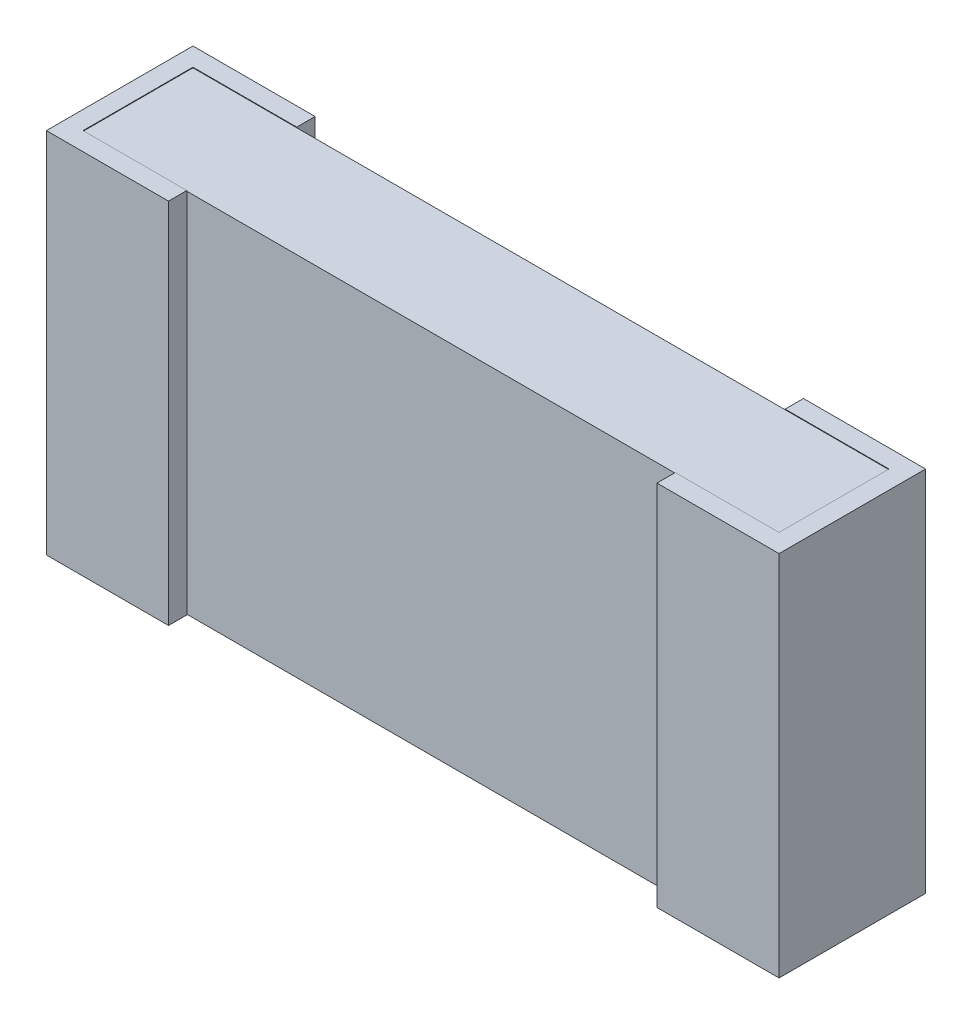
ISO-10303-21;
HEADER;
FILE_DESCRIPTION(('STEP AP214'),'2;1');
FILE_NAME('part.step','',(''),(''),'','','');
FILE_SCHEMA(('AUTOMOTIVE_DESIGN { 1 0 10303 214 1 1 1 1 }'));
ENDSEC;
DATA;
#1=APPLICATION_CONTEXT('core data for automotive mechanical design processes');
#2=APPLICATION_PROTOCOL_DEFINITION('international standard','automotive_design',2000,#1);
#3=PRODUCT_CONTEXT('',#1,'mechanical');
#4=PRODUCT('Part','Part','',(#3));
#5=PRODUCT_RELATED_PRODUCT_CATEGORY('part','',(#4));
#6=PRODUCT_DEFINITION_FORMATION('','',#4);
#7=PRODUCT_DEFINITION_CONTEXT('part definition',#1,'design');
#8=PRODUCT_DEFINITION('design','',#6,#7);
#9=PRODUCT_DEFINITION_SHAPE('','',#8);
#10=(LENGTH_UNIT() NAMED_UNIT(*) SI_UNIT(.MILLI.,.METRE.));
#11=(NAMED_UNIT(*) PLANE_ANGLE_UNIT() SI_UNIT($,.RADIAN.));
#12=(NAMED_UNIT(*) SI_UNIT($,.STERADIAN.) SOLID_ANGLE_UNIT());
#13=UNCERTAINTY_MEASURE_WITH_UNIT(LENGTH_MEASURE(1.E-05),#10,'distance_accuracy_value','');
#14=(GEOMETRIC_REPRESENTATION_CONTEXT(3) GLOBAL_UNCERTAINTY_ASSIGNED_CONTEXT((#13)) GLOBAL_UNIT_ASSIGNED_CONTEXT((#10,
#11,#12)) REPRESENTATION_CONTEXT('',''));
#15=CARTESIAN_POINT('',(0.,0.,0.));
#16=DIRECTION('',(0.,0.,1.));
#17=DIRECTION('',(1.,0.,0.));
#18=AXIS2_PLACEMENT_3D('',#15,#16,#17);
#19=CARTESIAN_POINT('',(0.507999999999976,-0.76454,0.));
#20=DIRECTION('',(0.,0.,-1.));
#21=DIRECTION('',(-1.,0.,0.));
#22=AXIS2_PLACEMENT_3D('',#19,#20,#21);
#23=PLANE('',#22);
#24=DIRECTION('',(-1.,0.,0.));
#25=VECTOR('',#24,1.);
#26=CARTESIAN_POINT('',(0.507999999999976,-0.76454,0.));
#27=LINE('',#26,#25);
#28=CARTESIAN_POINT('',(0.507999999999976,-0.76454,0.));
#29=VERTEX_POINT('',#28);
#30=CARTESIAN_POINT('',(0.,-0.76454,0.));
#31=VERTEX_POINT('',#30);
#32=EDGE_CURVE('E181',#29,#31,#27,.T.);
#33=ORIENTED_EDGE('',*,*,#32,.T.);
#34=DIRECTION('',(0.,1.,0.));
#35=VECTOR('',#34,1.);
#36=CARTESIAN_POINT('',(0.,-0.76454,0.));
#37=LINE('',#36,#35);
#38=CARTESIAN_POINT('',(0.,0.76454,0.));
#39=VERTEX_POINT('',#38);
#40=EDGE_CURVE('E183',#39,#31,#37,.F.);
#41=ORIENTED_EDGE('',*,*,#40,.F.);
#42=DIRECTION('',(-1.,0.,0.));
#43=VECTOR('',#42,1.);
#44=CARTESIAN_POINT('',(0.507999999999976,0.76454,0.));
#45=LINE('',#44,#43);
#46=CARTESIAN_POINT('',(0.507999999999976,0.76454,0.));
#47=VERTEX_POINT('',#46);
#48=EDGE_CURVE('E20',#39,#47,#45,.F.);
#49=ORIENTED_EDGE('',*,*,#48,.T.);
#50=DIRECTION('',(0.,1.,0.));
#51=VECTOR('',#50,1.);
#52=CARTESIAN_POINT('',(0.507999999999976,-0.76454,0.));
#53=LINE('',#52,#51);
#54=EDGE_CURVE('E186',#29,#47,#53,.T.);
#55=ORIENTED_EDGE('',*,*,#54,.F.);
#56=EDGE_LOOP('',(#33,#41,#49,#55));
#57=FACE_BOUND('',#56,.T.);
#58=ADVANCED_FACE('F17',(#57),#23,.T.);
#59=CARTESIAN_POINT('',(2.54000000000002,-0.76454,0.));
#60=DIRECTION('',(0.,0.,1.));
#61=DIRECTION('',(1.,0.,0.));
#62=AXIS2_PLACEMENT_3D('',#59,#60,#61);
#63=PLANE('',#62);
#64=DIRECTION('',(0.,1.,0.));
#65=VECTOR('',#64,1.);
#66=CARTESIAN_POINT('',(3.048,-0.76454,0.));
#67=LINE('',#66,#65);
#68=CARTESIAN_POINT('',(3.048,0.76454,0.));
#69=VERTEX_POINT('',#68);
#70=CARTESIAN_POINT('',(3.048,-0.76454,0.));
#71=VERTEX_POINT('',#70);
#72=EDGE_CURVE('E220',#69,#71,#67,.F.);
#73=ORIENTED_EDGE('',*,*,#72,.T.);
#74=DIRECTION('',(1.,0.,0.));
#75=VECTOR('',#74,1.);
#76=CARTESIAN_POINT('',(2.54000000000002,-0.76454,0.));
#77=LINE('',#76,#75);
#78=CARTESIAN_POINT('',(2.54000000000001,-0.76454,0.));
#79=VERTEX_POINT('',#78);
#80=EDGE_CURVE('E175',#79,#71,#77,.T.);
#81=ORIENTED_EDGE('',*,*,#80,.F.);
#82=DIRECTION('',(0.,1.,0.));
#83=VECTOR('',#82,1.);
#84=CARTESIAN_POINT('',(2.54000000000002,-0.76454,0.));
#85=LINE('',#84,#83);
#86=CARTESIAN_POINT('',(2.54000000000002,0.76454,0.));
#87=VERTEX_POINT('',#86);
#88=EDGE_CURVE('E230',#79,#87,#85,.T.);
#89=ORIENTED_EDGE('',*,*,#88,.T.);
#90=DIRECTION('',(1.,0.,0.));
#91=VECTOR('',#90,1.);
#92=CARTESIAN_POINT('',(2.54000000000002,0.76454,0.));
#93=LINE('',#92,#91);
#94=EDGE_CURVE('E196',#69,#87,#93,.F.);
#95=ORIENTED_EDGE('',*,*,#94,.F.);
#96=EDGE_LOOP('',(#73,#81,#89,#95));
#97=FACE_BOUND('',#96,.T.);
#98=ADVANCED_FACE('F227',(#97),#63,.F.);
#99=CARTESIAN_POINT('',(0.,-0.76454,0.));
#100=DIRECTION('',(-1.,0.,0.));
#101=DIRECTION('',(0.,0.,1.));
#102=AXIS2_PLACEMENT_3D('',#99,#100,#101);
#103=PLANE('',#102);
#104=DIRECTION('',(0.,0.,1.));
#105=VECTOR('',#104,1.);
#106=CARTESIAN_POINT('',(0.,-0.76454,0.));
#107=LINE('',#106,#105);
#108=CARTESIAN_POINT('',(0.,-0.76454,0.609599999999878));
#109=VERTEX_POINT('',#108);
#110=EDGE_CURVE('E193',#31,#109,#107,.T.);
#111=ORIENTED_EDGE('',*,*,#110,.T.);
#112=DIRECTION('',(0.,1.,0.));
#113=VECTOR('',#112,1.);
#114=CARTESIAN_POINT('',(0.,-0.76454,0.609599999999878));
#115=LINE('',#114,#113);
#116=CARTESIAN_POINT('',(0.,0.76454,0.609599999999878));
#117=VERTEX_POINT('',#116);
#118=EDGE_CURVE('E250',#117,#109,#115,.F.);
#119=ORIENTED_EDGE('',*,*,#118,.F.);
#120=DIRECTION('',(0.,0.,-1.));
#121=VECTOR('',#120,1.);
#122=CARTESIAN_POINT('',(0.,0.76454,0.533400000000122));
#123=LINE('',#122,#121);
#124=EDGE_CURVE('E195',#117,#39,#123,.T.);
#125=ORIENTED_EDGE('',*,*,#124,.T.);
#126=ORIENTED_EDGE('',*,*,#40,.T.);
#127=EDGE_LOOP('',(#111,#119,#125,#126));
#128=FACE_BOUND('',#127,.T.);
#129=ADVANCED_FACE('F191',(#128),#103,.T.);
#130=CARTESIAN_POINT('',(0.508,-0.76454,0.0762000000001224));
#131=DIRECTION('',(1.,0.,-3.10178574280132E-13));
#132=DIRECTION('',(-3.10178574280132E-13,0.,-1.));
#133=AXIS2_PLACEMENT_3D('',#130,#131,#132);
#134=PLANE('',#133);
#135=DIRECTION('',(0.,0.,-1.));
#136=VECTOR('',#135,1.);
#137=CARTESIAN_POINT('',(0.507999999999976,-0.76454,0.533400000000122));
#138=LINE('',#137,#136);
#139=CARTESIAN_POINT('',(0.507999999999994,-0.76454,0.0762000000001224));
#140=VERTEX_POINT('',#139);
#141=EDGE_CURVE('E242',#29,#140,#138,.F.);
#142=ORIENTED_EDGE('',*,*,#141,.F.);
#143=ORIENTED_EDGE('',*,*,#54,.T.);
#144=DIRECTION('',(0.,0.,-1.));
#145=VECTOR('',#144,1.);
#146=CARTESIAN_POINT('',(0.507999999999976,0.76454,0.533400000000122));
#147=LINE('',#146,#145);
#148=CARTESIAN_POINT('',(0.507999999999994,0.76454,0.0762000000001224));
#149=VERTEX_POINT('',#148);
#150=EDGE_CURVE('E239',#47,#149,#147,.F.);
#151=ORIENTED_EDGE('',*,*,#150,.T.);
#152=DIRECTION('',(0.,1.,0.));
#153=VECTOR('',#152,1.);
#154=CARTESIAN_POINT('',(0.508,-0.76454,0.0762000000001224));
#155=LINE('',#154,#153);
#156=CARTESIAN_POINT('',(0.508,0.762,0.0762000000001224));
#157=VERTEX_POINT('',#156);
#158=EDGE_CURVE('E203',#149,#157,#155,.F.);
#159=ORIENTED_EDGE('',*,*,#158,.T.);
#160=DIRECTION('',(0.,1.,0.));
#161=VECTOR('',#160,1.);
#162=CARTESIAN_POINT('',(0.508,0.762,0.0762000000001225));
#163=LINE('',#162,#161);
#164=CARTESIAN_POINT('',(0.508,-0.762,0.0762000000001224));
#165=VERTEX_POINT('',#164);
#166=EDGE_CURVE('E288',#157,#165,#163,.F.);
#167=ORIENTED_EDGE('',*,*,#166,.T.);
#168=DIRECTION('',(0.,1.,0.));
#169=VECTOR('',#168,1.);
#170=CARTESIAN_POINT('',(0.508,-0.76454,0.0762000000001224));
#171=LINE('',#170,#169);
#172=EDGE_CURVE('E258',#165,#140,#171,.F.);
#173=ORIENTED_EDGE('',*,*,#172,.T.);
#174=EDGE_LOOP('',(#142,#143,#151,#159,#167,#173));
#175=FACE_BOUND('',#174,.T.);
#176=ADVANCED_FACE('F238',(#175),#134,.T.);
#177=CARTESIAN_POINT('',(2.54,-0.76454,0.0762000000001224));
#178=DIRECTION('',(1.,0.,3.10178574280132E-13));
#179=DIRECTION('',(3.10178574280132E-13,0.,-1.));
#180=AXIS2_PLACEMENT_3D('',#177,#178,#179);
#181=PLANE('',#180);
#182=ORIENTED_EDGE('',*,*,#88,.F.);
#183=DIRECTION('',(3.10178574280132E-13,0.,-1.));
#184=VECTOR('',#183,1.);
#185=CARTESIAN_POINT('',(2.54,-0.76454,0.0762000000001224));
#186=LINE('',#185,#184);
#187=CARTESIAN_POINT('',(2.54,-0.76454,0.0762000000001224));
#188=VERTEX_POINT('',#187);
#189=EDGE_CURVE('E216',#188,#79,#186,.T.);
#190=ORIENTED_EDGE('',*,*,#189,.F.);
#191=DIRECTION('',(0.,1.,0.));
#192=VECTOR('',#191,1.);
#193=CARTESIAN_POINT('',(2.54,-0.76454,0.0762000000001224));
#194=LINE('',#193,#192);
#195=CARTESIAN_POINT('',(2.54,-0.762,0.0762000000001225));
#196=VERTEX_POINT('',#195);
#197=EDGE_CURVE('E262',#196,#188,#194,.F.);
#198=ORIENTED_EDGE('',*,*,#197,.F.);
#199=DIRECTION('',(0.,1.,0.));
#200=VECTOR('',#199,1.);
#201=CARTESIAN_POINT('',(2.54,0.762,0.0762000000001228));
#202=LINE('',#201,#200);
#203=CARTESIAN_POINT('',(2.54,0.762,0.0762000000001225));
#204=VERTEX_POINT('',#203);
#205=EDGE_CURVE('E285',#196,#204,#202,.T.);
#206=ORIENTED_EDGE('',*,*,#205,.T.);
#207=DIRECTION('',(0.,1.,0.));
#208=VECTOR('',#207,1.);
#209=CARTESIAN_POINT('',(2.54,-0.76454,0.0762000000001224));
#210=LINE('',#209,#208);
#211=CARTESIAN_POINT('',(2.54,0.76454,0.0762000000001224));
#212=VERTEX_POINT('',#211);
#213=EDGE_CURVE('E293',#212,#204,#210,.F.);
#214=ORIENTED_EDGE('',*,*,#213,.F.);
#215=DIRECTION('',(3.10178574280132E-13,0.,-1.));
#216=VECTOR('',#215,1.);
#217=CARTESIAN_POINT('',(2.54,0.76454,0.0762000000001224));
#218=LINE('',#217,#216);
#219=EDGE_CURVE('E228',#87,#212,#218,.F.);
#220=ORIENTED_EDGE('',*,*,#219,.F.);
#221=EDGE_LOOP('',(#182,#190,#198,#206,#214,#220));
#222=FACE_BOUND('',#221,.T.);
#223=ADVANCED_FACE('F375',(#222),#181,.F.);
#224=CARTESIAN_POINT('',(3.048,-0.76454,0.));
#225=DIRECTION('',(-1.,0.,0.));
#226=DIRECTION('',(0.,0.,1.));
#227=AXIS2_PLACEMENT_3D('',#224,#225,#226);
#228=PLANE('',#227);
#229=DIRECTION('',(0.,1.,0.));
#230=VECTOR('',#229,1.);
#231=CARTESIAN_POINT('',(3.048,-0.76454,0.609599999999878));
#232=LINE('',#231,#230);
#233=CARTESIAN_POINT('',(3.048,0.76454,0.609599999999878));
#234=VERTEX_POINT('',#233);
#235=CARTESIAN_POINT('',(3.048,-0.76454,0.609599999999878));
#236=VERTEX_POINT('',#235);
#237=EDGE_CURVE('E223',#234,#236,#232,.F.);
#238=ORIENTED_EDGE('',*,*,#237,.T.);
#239=DIRECTION('',(0.,0.,1.));
#240=VECTOR('',#239,1.);
#241=CARTESIAN_POINT('',(3.048,-0.76454,0.));
#242=LINE('',#241,#240);
#243=EDGE_CURVE('E213',#71,#236,#242,.T.);
#244=ORIENTED_EDGE('',*,*,#243,.F.);
#245=ORIENTED_EDGE('',*,*,#72,.F.);
#246=DIRECTION('',(0.,0.,1.));
#247=VECTOR('',#246,1.);
#248=CARTESIAN_POINT('',(3.048,0.76454,0.));
#249=LINE('',#248,#247);
#250=EDGE_CURVE('E225',#234,#69,#249,.F.);
#251=ORIENTED_EDGE('',*,*,#250,.F.);
#252=EDGE_LOOP('',(#238,#244,#245,#251));
#253=FACE_BOUND('',#252,.T.);
#254=ADVANCED_FACE('F219',(#253),#228,.F.);
#255=CARTESIAN_POINT('',(2.9718,-0.76454,0.0762000000001224));
#256=DIRECTION('',(-1.,0.,0.));
#257=DIRECTION('',(0.,0.,1.));
#258=AXIS2_PLACEMENT_3D('',#255,#256,#257);
#259=PLANE('',#258);
#260=DIRECTION('',(0.,0.,-1.));
#261=VECTOR('',#260,1.);
#262=CARTESIAN_POINT('',(2.9718,-0.76454,0.533400000000122));
#263=LINE('',#262,#261);
#264=CARTESIAN_POINT('',(2.9718,-0.76454,0.533400000000122));
#265=VERTEX_POINT('',#264);
#266=CARTESIAN_POINT('',(2.9718,-0.76454,0.0762000000001226));
#267=VERTEX_POINT('',#266);
#268=EDGE_CURVE('E275',#265,#267,#263,.T.);
#269=ORIENTED_EDGE('',*,*,#268,.F.);
#270=DIRECTION('',(0.,1.,0.));
#271=VECTOR('',#270,1.);
#272=CARTESIAN_POINT('',(2.9718,-0.76454,0.533400000000122));
#273=LINE('',#272,#271);
#274=CARTESIAN_POINT('',(2.9718,-0.762,0.533400000000122));
#275=VERTEX_POINT('',#274);
#276=EDGE_CURVE('E363',#275,#265,#273,.F.);
#277=ORIENTED_EDGE('',*,*,#276,.F.);
#278=DIRECTION('',(0.,0.,1.));
#279=VECTOR('',#278,1.);
#280=CARTESIAN_POINT('',(2.9718,-0.762,0.0762000000001225));
#281=LINE('',#280,#279);
#282=CARTESIAN_POINT('',(2.9718,-0.762,0.0762000000001227));
#283=VERTEX_POINT('',#282);
#284=EDGE_CURVE('E340',#275,#283,#281,.F.);
#285=ORIENTED_EDGE('',*,*,#284,.T.);
#286=DIRECTION('',(0.,1.,0.));
#287=VECTOR('',#286,1.);
#288=CARTESIAN_POINT('',(2.9718,-0.76454,0.0762000000001224));
#289=LINE('',#288,#287);
#290=EDGE_CURVE('E260',#267,#283,#289,.T.);
#291=ORIENTED_EDGE('',*,*,#290,.F.);
#292=EDGE_LOOP('',(#269,#277,#285,#291));
#293=FACE_BOUND('',#292,.T.);
#294=ADVANCED_FACE('F448',(#293),#259,.T.);
#295=CARTESIAN_POINT('',(2.54,-0.76454,0.0762000000001224));
#296=DIRECTION('',(0.,0.,1.));
#297=DIRECTION('',(1.,0.,0.));
#298=AXIS2_PLACEMENT_3D('',#295,#296,#297);
#299=PLANE('',#298);
#300=DIRECTION('',(1.,0.,0.));
#301=VECTOR('',#300,1.);
#302=CARTESIAN_POINT('',(3.048,-0.76454,0.0762000000001224));
#303=LINE('',#302,#301);
#304=EDGE_CURVE('E277',#267,#188,#303,.F.);
#305=ORIENTED_EDGE('',*,*,#304,.F.);
#306=ORIENTED_EDGE('',*,*,#290,.T.);
#307=DIRECTION('',(1.,0.,0.));
#308=VECTOR('',#307,1.);
#309=CARTESIAN_POINT('',(0.0762000000000002,-0.762,0.0762000000001228));
#310=LINE('',#309,#308);
#311=EDGE_CURVE('E337',#283,#196,#310,.F.);
#312=ORIENTED_EDGE('',*,*,#311,.T.);
#313=ORIENTED_EDGE('',*,*,#197,.T.);
#314=EDGE_LOOP('',(#305,#306,#312,#313));
#315=FACE_BOUND('',#314,.T.);
#316=ADVANCED_FACE('F370',(#315),#299,.T.);
#317=CARTESIAN_POINT('',(0.508,-0.76454,0.0762000000001224));
#318=DIRECTION('',(0.,0.,-1.));
#319=DIRECTION('',(-1.,0.,0.));
#320=AXIS2_PLACEMENT_3D('',#317,#318,#319);
#321=PLANE('',#320);
#322=DIRECTION('',(1.,0.,0.));
#323=VECTOR('',#322,1.);
#324=CARTESIAN_POINT('',(0.0762000000000002,-0.762,0.0762000000001224));
#325=LINE('',#324,#323);
#326=CARTESIAN_POINT('',(0.0762000000000002,-0.762,0.0762000000001224));
#327=VERTEX_POINT('',#326);
#328=EDGE_CURVE('E328',#165,#327,#325,.F.);
#329=ORIENTED_EDGE('',*,*,#328,.T.);
#330=DIRECTION('',(0.,1.,0.));
#331=VECTOR('',#330,1.);
#332=CARTESIAN_POINT('',(0.0762000000000002,-0.76454,0.0762000000001225));
#333=LINE('',#332,#331);
#334=CARTESIAN_POINT('',(0.0762000000000002,-0.76454,0.0762000000001224));
#335=VERTEX_POINT('',#334);
#336=EDGE_CURVE('E252',#327,#335,#333,.F.);
#337=ORIENTED_EDGE('',*,*,#336,.T.);
#338=DIRECTION('',(1.,0.,0.));
#339=VECTOR('',#338,1.);
#340=CARTESIAN_POINT('',(0.,-0.76454,0.0762000000001224));
#341=LINE('',#340,#339);
#342=EDGE_CURVE('E311',#140,#335,#341,.F.);
#343=ORIENTED_EDGE('',*,*,#342,.F.);
#344=ORIENTED_EDGE('',*,*,#172,.F.);
#345=EDGE_LOOP('',(#329,#337,#343,#344));
#346=FACE_BOUND('',#345,.T.);
#347=ADVANCED_FACE('F456',(#346),#321,.F.);
#348=CARTESIAN_POINT('',(0.0762000000000002,-0.76454,0.0762000000001224));
#349=DIRECTION('',(-1.,0.,0.));
#350=DIRECTION('',(0.,0.,1.));
#351=AXIS2_PLACEMENT_3D('',#348,#349,#350);
#352=PLANE('',#351);
#353=DIRECTION('',(0.,0.,1.));
#354=VECTOR('',#353,1.);
#355=CARTESIAN_POINT('',(0.0762000000000002,-0.762,0.0762000000001225));
#356=LINE('',#355,#354);
#357=CARTESIAN_POINT('',(0.0762000000000001,-0.762,0.533400000000122));
#358=VERTEX_POINT('',#357);
#359=EDGE_CURVE('E323',#327,#358,#356,.T.);
#360=ORIENTED_EDGE('',*,*,#359,.T.);
#361=DIRECTION('',(0.,1.,0.));
#362=VECTOR('',#361,1.);
#363=CARTESIAN_POINT('',(0.0762,-0.76454,0.533400000000122));
#364=LINE('',#363,#362);
#365=CARTESIAN_POINT('',(0.0762000000000001,-0.76454,0.533400000000122));
#366=VERTEX_POINT('',#365);
#367=EDGE_CURVE('E303',#358,#366,#364,.F.);
#368=ORIENTED_EDGE('',*,*,#367,.T.);
#369=DIRECTION('',(0.,0.,-1.));
#370=VECTOR('',#369,1.);
#371=CARTESIAN_POINT('',(0.0762000000000002,-0.76454,0.533400000000122));
#372=LINE('',#371,#370);
#373=EDGE_CURVE('E309',#335,#366,#372,.F.);
#374=ORIENTED_EDGE('',*,*,#373,.F.);
#375=ORIENTED_EDGE('',*,*,#336,.F.);
#376=EDGE_LOOP('',(#360,#368,#374,#375));
#377=FACE_BOUND('',#376,.T.);
#378=ADVANCED_FACE('F515',(#377),#352,.F.);
#379=CARTESIAN_POINT('',(0.,0.76454,0.533400000000122));
#380=DIRECTION('',(0.,-1.,0.));
#381=DIRECTION('',(0.,0.,-1.));
#382=AXIS2_PLACEMENT_3D('',#379,#380,#381);
#383=PLANE('',#382);
#384=DIRECTION('',(0.,0.,1.));
#385=VECTOR('',#384,1.);
#386=CARTESIAN_POINT('',(0.0762000000000002,0.76454,0.0762000000001224));
#387=LINE('',#386,#385);
#388=CARTESIAN_POINT('',(0.0762000000000001,0.76454,0.533400000000122));
#389=VERTEX_POINT('',#388);
#390=CARTESIAN_POINT('',(0.0762000000000002,0.76454,0.0762000000001224));
#391=VERTEX_POINT('',#390);
#392=EDGE_CURVE('E301',#389,#391,#387,.F.);
#393=ORIENTED_EDGE('',*,*,#392,.T.);
#394=DIRECTION('',(-1.,0.,0.));
#395=VECTOR('',#394,1.);
#396=CARTESIAN_POINT('',(0.508,0.76454,0.0762000000001224));
#397=LINE('',#396,#395);
#398=EDGE_CURVE('E246',#391,#149,#397,.F.);
#399=ORIENTED_EDGE('',*,*,#398,.T.);
#400=ORIENTED_EDGE('',*,*,#150,.F.);
#401=ORIENTED_EDGE('',*,*,#48,.F.);
#402=ORIENTED_EDGE('',*,*,#124,.F.);
#403=DIRECTION('',(1.,0.,0.));
#404=VECTOR('',#403,1.);
#405=CARTESIAN_POINT('',(0.,0.76454,0.609599999999878));
#406=LINE('',#405,#404);
#407=CARTESIAN_POINT('',(0.507999999999988,0.76454,0.609599999999878));
#408=VERTEX_POINT('',#407);
#409=EDGE_CURVE('E247',#408,#117,#406,.F.);
#410=ORIENTED_EDGE('',*,*,#409,.F.);
#411=DIRECTION('',(-3.08755736784921E-13,0.,-1.));
#412=VECTOR('',#411,1.);
#413=CARTESIAN_POINT('',(0.508,0.76454,0.609599999999878));
#414=LINE('',#413,#412);
#415=CARTESIAN_POINT('',(0.507999999999976,0.76454,0.533400000000122));
#416=VERTEX_POINT('',#415);
#417=EDGE_CURVE('E320',#416,#408,#414,.F.);
#418=ORIENTED_EDGE('',*,*,#417,.F.);
#419=DIRECTION('',(1.,0.,0.));
#420=VECTOR('',#419,1.);
#421=CARTESIAN_POINT('',(0.0762,0.76454,0.533400000000122));
#422=LINE('',#421,#420);
#423=EDGE_CURVE('E298',#416,#389,#422,.F.);
#424=ORIENTED_EDGE('',*,*,#423,.T.);
#425=EDGE_LOOP('',(#393,#399,#400,#401,#402,#410,#418,#424));
#426=FACE_BOUND('',#425,.T.);
#427=ADVANCED_FACE('F244',(#426),#383,.F.);
#428=CARTESIAN_POINT('',(0.,-0.76454,0.609599999999878));
#429=DIRECTION('',(0.,0.,1.));
#430=DIRECTION('',(1.,0.,0.));
#431=AXIS2_PLACEMENT_3D('',#428,#429,#430);
#432=PLANE('',#431);
#433=DIRECTION('',(1.,0.,0.));
#434=VECTOR('',#433,1.);
#435=CARTESIAN_POINT('',(0.,-0.76454,0.609599999999878));
#436=LINE('',#435,#434);
#437=CARTESIAN_POINT('',(0.507999999999994,-0.76454,0.609599999999878));
#438=VERTEX_POINT('',#437);
#439=EDGE_CURVE('E202',#438,#109,#436,.F.);
#440=ORIENTED_EDGE('',*,*,#439,.F.);
#441=DIRECTION('',(0.,1.,0.));
#442=VECTOR('',#441,1.);
#443=CARTESIAN_POINT('',(0.508,-0.76454,0.609599999999878));
#444=LINE('',#443,#442);
#445=EDGE_CURVE('E318',#408,#438,#444,.F.);
#446=ORIENTED_EDGE('',*,*,#445,.F.);
#447=ORIENTED_EDGE('',*,*,#409,.T.);
#448=ORIENTED_EDGE('',*,*,#118,.T.);
#449=EDGE_LOOP('',(#440,#446,#447,#448));
#450=FACE_BOUND('',#449,.T.);
#451=ADVANCED_FACE('F315',(#450),#432,.T.);
#452=CARTESIAN_POINT('',(0.,-0.76454,0.533400000000122));
#453=DIRECTION('',(0.,-1.,0.));
#454=DIRECTION('',(0.,0.,-1.));
#455=AXIS2_PLACEMENT_3D('',#452,#453,#454);
#456=PLANE('',#455);
#457=ORIENTED_EDGE('',*,*,#342,.T.);
#458=ORIENTED_EDGE('',*,*,#373,.T.);
#459=DIRECTION('',(1.,0.,0.));
#460=VECTOR('',#459,1.);
#461=CARTESIAN_POINT('',(0.0762,-0.76454,0.533400000000122));
#462=LINE('',#461,#460);
#463=CARTESIAN_POINT('',(0.507999999999976,-0.76454,0.533400000000122));
#464=VERTEX_POINT('',#463);
#465=EDGE_CURVE('E306',#366,#464,#462,.T.);
#466=ORIENTED_EDGE('',*,*,#465,.T.);
#467=DIRECTION('',(-3.08755736784921E-13,0.,-1.));
#468=VECTOR('',#467,1.);
#469=CARTESIAN_POINT('',(0.508,-0.76454,0.609599999999878));
#470=LINE('',#469,#468);
#471=EDGE_CURVE('E325',#438,#464,#470,.T.);
#472=ORIENTED_EDGE('',*,*,#471,.F.);
#473=ORIENTED_EDGE('',*,*,#439,.T.);
#474=ORIENTED_EDGE('',*,*,#110,.F.);
#475=ORIENTED_EDGE('',*,*,#32,.F.);
#476=ORIENTED_EDGE('',*,*,#141,.T.);
#477=EDGE_LOOP('',(#457,#458,#466,#472,#473,#474,#475,#476));
#478=FACE_BOUND('',#477,.T.);
#479=ADVANCED_FACE('F199',(#478),#456,.T.);
#480=CARTESIAN_POINT('',(0.0762,-0.76454,0.533400000000122));
#481=DIRECTION('',(0.,0.,1.));
#482=DIRECTION('',(1.,0.,0.));
#483=AXIS2_PLACEMENT_3D('',#480,#481,#482);
#484=PLANE('',#483);
#485=DIRECTION('',(1.,0.,0.));
#486=VECTOR('',#485,1.);
#487=CARTESIAN_POINT('',(0.0762000000000002,-0.762,0.533400000000122));
#488=LINE('',#487,#486);
#489=CARTESIAN_POINT('',(0.507999999999976,-0.762,0.533400000000122));
#490=VERTEX_POINT('',#489);
#491=EDGE_CURVE('E346',#358,#490,#488,.T.);
#492=ORIENTED_EDGE('',*,*,#491,.T.);
#493=DIRECTION('',(0.,1.,0.));
#494=VECTOR('',#493,1.);
#495=CARTESIAN_POINT('',(0.507999999999976,-0.76454,0.533400000000122));
#496=LINE('',#495,#494);
#497=EDGE_CURVE('E411',#464,#490,#496,.T.);
#498=ORIENTED_EDGE('',*,*,#497,.F.);
#499=ORIENTED_EDGE('',*,*,#465,.F.);
#500=ORIENTED_EDGE('',*,*,#367,.F.);
#501=EDGE_LOOP('',(#492,#498,#499,#500));
#502=FACE_BOUND('',#501,.T.);
#503=ADVANCED_FACE('F418',(#502),#484,.F.);
#504=CARTESIAN_POINT('',(0.0762000000000002,-0.76454,0.0762000000001224));
#505=DIRECTION('',(-1.,0.,0.));
#506=DIRECTION('',(0.,0.,1.));
#507=AXIS2_PLACEMENT_3D('',#504,#505,#506);
#508=PLANE('',#507);
#509=DIRECTION('',(0.,1.,0.));
#510=VECTOR('',#509,1.);
#511=CARTESIAN_POINT('',(0.0762000000000002,-0.76454,0.0762000000001224));
#512=LINE('',#511,#510);
#513=CARTESIAN_POINT('',(0.0762000000000002,0.762,0.0762000000001224));
#514=VERTEX_POINT('',#513);
#515=EDGE_CURVE('E279',#514,#391,#512,.T.);
#516=ORIENTED_EDGE('',*,*,#515,.T.);
#517=ORIENTED_EDGE('',*,*,#392,.F.);
#518=DIRECTION('',(0.,1.,0.));
#519=VECTOR('',#518,1.);
#520=CARTESIAN_POINT('',(0.0762,-0.76454,0.533400000000122));
#521=LINE('',#520,#519);
#522=CARTESIAN_POINT('',(0.0762000000000001,0.762,0.533400000000122));
#523=VERTEX_POINT('',#522);
#524=EDGE_CURVE('E295',#389,#523,#521,.F.);
#525=ORIENTED_EDGE('',*,*,#524,.T.);
#526=DIRECTION('',(0.,0.,1.));
#527=VECTOR('',#526,1.);
#528=CARTESIAN_POINT('',(0.0762000000000002,0.762,0.0762000000001225));
#529=LINE('',#528,#527);
#530=EDGE_CURVE('E407',#514,#523,#529,.T.);
#531=ORIENTED_EDGE('',*,*,#530,.F.);
#532=EDGE_LOOP('',(#516,#517,#525,#531));
#533=FACE_BOUND('',#532,.T.);
#534=ADVANCED_FACE('F502',(#533),#508,.F.);
#535=CARTESIAN_POINT('',(0.0762,-0.76454,0.533400000000122));
#536=DIRECTION('',(0.,0.,1.));
#537=DIRECTION('',(1.,0.,0.));
#538=AXIS2_PLACEMENT_3D('',#535,#536,#537);
#539=PLANE('',#538);
#540=ORIENTED_EDGE('',*,*,#524,.F.);
#541=ORIENTED_EDGE('',*,*,#423,.F.);
#542=DIRECTION('',(0.,1.,0.));
#543=VECTOR('',#542,1.);
#544=CARTESIAN_POINT('',(0.507999999999976,-0.76454,0.533400000000122));
#545=LINE('',#544,#543);
#546=CARTESIAN_POINT('',(0.507999999999976,0.762,0.533400000000122));
#547=VERTEX_POINT('',#546);
#548=EDGE_CURVE('E409',#547,#416,#545,.T.);
#549=ORIENTED_EDGE('',*,*,#548,.F.);
#550=DIRECTION('',(1.,0.,0.));
#551=VECTOR('',#550,1.);
#552=CARTESIAN_POINT('',(0.0762000000000002,0.762,0.533400000000122));
#553=LINE('',#552,#551);
#554=EDGE_CURVE('E405',#523,#547,#553,.T.);
#555=ORIENTED_EDGE('',*,*,#554,.F.);
#556=EDGE_LOOP('',(#540,#541,#549,#555));
#557=FACE_BOUND('',#556,.T.);
#558=ADVANCED_FACE('F498',(#557),#539,.F.);
#559=CARTESIAN_POINT('',(2.9718,-0.76454,0.0762000000001224));
#560=DIRECTION('',(-1.,0.,0.));
#561=DIRECTION('',(0.,0.,1.));
#562=AXIS2_PLACEMENT_3D('',#559,#560,#561);
#563=PLANE('',#562);
#564=DIRECTION('',(0.,1.,0.));
#565=VECTOR('',#564,1.);
#566=CARTESIAN_POINT('',(2.9718,-0.76454,0.533400000000122));
#567=LINE('',#566,#565);
#568=CARTESIAN_POINT('',(2.9718,0.76454,0.533400000000122));
#569=VERTEX_POINT('',#568);
#570=CARTESIAN_POINT('',(2.9718,0.762,0.533400000000122));
#571=VERTEX_POINT('',#570);
#572=EDGE_CURVE('E359',#569,#571,#567,.F.);
#573=ORIENTED_EDGE('',*,*,#572,.F.);
#574=DIRECTION('',(0.,0.,-1.));
#575=VECTOR('',#574,1.);
#576=CARTESIAN_POINT('',(2.9718,0.76454,0.533400000000122));
#577=LINE('',#576,#575);
#578=CARTESIAN_POINT('',(2.9718,0.76454,0.0762000000001224));
#579=VERTEX_POINT('',#578);
#580=EDGE_CURVE('E356',#569,#579,#577,.T.);
#581=ORIENTED_EDGE('',*,*,#580,.T.);
#582=DIRECTION('',(0.,1.,0.));
#583=VECTOR('',#582,1.);
#584=CARTESIAN_POINT('',(2.9718,-0.76454,0.0762000000001224));
#585=LINE('',#584,#583);
#586=CARTESIAN_POINT('',(2.9718,0.762,0.0762000000001225));
#587=VERTEX_POINT('',#586);
#588=EDGE_CURVE('E291',#587,#579,#585,.T.);
#589=ORIENTED_EDGE('',*,*,#588,.F.);
#590=DIRECTION('',(0.,0.,1.));
#591=VECTOR('',#590,1.);
#592=CARTESIAN_POINT('',(2.9718,0.762,0.0762000000001225));
#593=LINE('',#592,#591);
#594=EDGE_CURVE('E397',#571,#587,#593,.F.);
#595=ORIENTED_EDGE('',*,*,#594,.F.);
#596=EDGE_LOOP('',(#573,#581,#589,#595));
#597=FACE_BOUND('',#596,.T.);
#598=ADVANCED_FACE('F494',(#597),#563,.T.);
#599=CARTESIAN_POINT('',(2.54,-0.76454,0.0762000000001224));
#600=DIRECTION('',(0.,0.,1.));
#601=DIRECTION('',(1.,0.,0.));
#602=AXIS2_PLACEMENT_3D('',#599,#600,#601);
#603=PLANE('',#602);
#604=ORIENTED_EDGE('',*,*,#588,.T.);
#605=DIRECTION('',(1.,0.,0.));
#606=VECTOR('',#605,1.);
#607=CARTESIAN_POINT('',(3.048,0.76454,0.0762000000001224));
#608=LINE('',#607,#606);
#609=EDGE_CURVE('E353',#579,#212,#608,.F.);
#610=ORIENTED_EDGE('',*,*,#609,.T.);
#611=ORIENTED_EDGE('',*,*,#213,.T.);
#612=DIRECTION('',(1.,0.,0.));
#613=VECTOR('',#612,1.);
#614=CARTESIAN_POINT('',(0.0762000000000002,0.762,0.0762000000001228));
#615=LINE('',#614,#613);
#616=EDGE_CURVE('E393',#587,#204,#615,.F.);
#617=ORIENTED_EDGE('',*,*,#616,.F.);
#618=EDGE_LOOP('',(#604,#610,#611,#617));
#619=FACE_BOUND('',#618,.T.);
#620=ADVANCED_FACE('F491',(#619),#603,.T.);
#621=CARTESIAN_POINT('',(2.9718,0.762,0.0762000000001228));
#622=DIRECTION('',(0.,0.,1.));
#623=DIRECTION('',(1.,0.,0.));
#624=AXIS2_PLACEMENT_3D('',#621,#622,#623);
#625=PLANE('',#624);
#626=DIRECTION('',(1.,0.,0.));
#627=VECTOR('',#626,1.);
#628=CARTESIAN_POINT('',(0.0762000000000002,-0.762,0.0762000000001224));
#629=LINE('',#628,#627);
#630=EDGE_CURVE('E334',#196,#165,#629,.F.);
#631=ORIENTED_EDGE('',*,*,#630,.T.);
#632=ORIENTED_EDGE('',*,*,#166,.F.);
#633=DIRECTION('',(1.,0.,0.));
#634=VECTOR('',#633,1.);
#635=CARTESIAN_POINT('',(0.0762000000000002,0.762,0.0762000000001224));
#636=LINE('',#635,#634);
#637=EDGE_CURVE('E387',#204,#157,#636,.F.);
#638=ORIENTED_EDGE('',*,*,#637,.F.);
#639=ORIENTED_EDGE('',*,*,#205,.F.);
#640=EDGE_LOOP('',(#631,#632,#638,#639));
#641=FACE_BOUND('',#640,.T.);
#642=ADVANCED_FACE('F385',(#641),#625,.F.);
#643=CARTESIAN_POINT('',(0.508,-0.76454,0.0762000000001224));
#644=DIRECTION('',(0.,0.,-1.));
#645=DIRECTION('',(-1.,0.,0.));
#646=AXIS2_PLACEMENT_3D('',#643,#644,#645);
#647=PLANE('',#646);
#648=ORIENTED_EDGE('',*,*,#158,.F.);
#649=ORIENTED_EDGE('',*,*,#398,.F.);
#650=ORIENTED_EDGE('',*,*,#515,.F.);
#651=DIRECTION('',(1.,0.,0.));
#652=VECTOR('',#651,1.);
#653=CARTESIAN_POINT('',(0.0762000000000002,0.762,0.0762000000001224));
#654=LINE('',#653,#652);
#655=EDGE_CURVE('E392',#157,#514,#654,.F.);
#656=ORIENTED_EDGE('',*,*,#655,.F.);
#657=EDGE_LOOP('',(#648,#649,#650,#656));
#658=FACE_BOUND('',#657,.T.);
#659=ADVANCED_FACE('F485',(#658),#647,.F.);
#660=CARTESIAN_POINT('',(3.048,-0.76454,0.609599999999878));
#661=DIRECTION('',(0.,0.,-1.));
#662=DIRECTION('',(-1.,0.,0.));
#663=AXIS2_PLACEMENT_3D('',#660,#661,#662);
#664=PLANE('',#663);
#665=DIRECTION('',(0.,1.,0.));
#666=VECTOR('',#665,1.);
#667=CARTESIAN_POINT('',(2.54,-0.76454,0.609599999999878));
#668=LINE('',#667,#666);
#669=CARTESIAN_POINT('',(2.54,0.76454,0.609599999999878));
#670=VERTEX_POINT('',#669);
#671=CARTESIAN_POINT('',(2.54,-0.76454,0.609599999999878));
#672=VERTEX_POINT('',#671);
#673=EDGE_CURVE('E395',#670,#672,#668,.F.);
#674=ORIENTED_EDGE('',*,*,#673,.T.);
#675=DIRECTION('',(1.,0.,0.));
#676=VECTOR('',#675,1.);
#677=CARTESIAN_POINT('',(3.048,-0.76454,0.609599999999878));
#678=LINE('',#677,#676);
#679=EDGE_CURVE('E274',#236,#672,#678,.F.);
#680=ORIENTED_EDGE('',*,*,#679,.F.);
#681=ORIENTED_EDGE('',*,*,#237,.F.);
#682=DIRECTION('',(1.,0.,0.));
#683=VECTOR('',#682,1.);
#684=CARTESIAN_POINT('',(3.048,0.76454,0.609599999999878));
#685=LINE('',#684,#683);
#686=EDGE_CURVE('E270',#234,#670,#685,.F.);
#687=ORIENTED_EDGE('',*,*,#686,.T.);
#688=EDGE_LOOP('',(#674,#680,#681,#687));
#689=FACE_BOUND('',#688,.T.);
#690=ADVANCED_FACE('F273',(#689),#664,.F.);
#691=CARTESIAN_POINT('',(3.048,-0.76454,0.533400000000122));
#692=DIRECTION('',(0.,-1.,0.));
#693=DIRECTION('',(0.,0.,-1.));
#694=AXIS2_PLACEMENT_3D('',#691,#692,#693);
#695=PLANE('',#694);
#696=ORIENTED_EDGE('',*,*,#679,.T.);
#697=DIRECTION('',(3.08755736784921E-13,0.,-1.));
#698=VECTOR('',#697,1.);
#699=CARTESIAN_POINT('',(2.54,-0.76454,0.609599999999878));
#700=LINE('',#699,#698);
#701=CARTESIAN_POINT('',(2.54000000000001,-0.76454,0.533400000000122));
#702=VERTEX_POINT('',#701);
#703=EDGE_CURVE('E440',#672,#702,#700,.T.);
#704=ORIENTED_EDGE('',*,*,#703,.T.);
#705=DIRECTION('',(-1.,0.,0.));
#706=VECTOR('',#705,1.);
#707=CARTESIAN_POINT('',(2.9718,-0.76454,0.533400000000122));
#708=LINE('',#707,#706);
#709=EDGE_CURVE('E361',#265,#702,#708,.T.);
#710=ORIENTED_EDGE('',*,*,#709,.F.);
#711=ORIENTED_EDGE('',*,*,#268,.T.);
#712=ORIENTED_EDGE('',*,*,#304,.T.);
#713=ORIENTED_EDGE('',*,*,#189,.T.);
#714=ORIENTED_EDGE('',*,*,#80,.T.);
#715=ORIENTED_EDGE('',*,*,#243,.T.);
#716=EDGE_LOOP('',(#696,#704,#710,#711,#712,#713,#714,#715));
#717=FACE_BOUND('',#716,.T.);
#718=ADVANCED_FACE('F212',(#717),#695,.T.);
#719=CARTESIAN_POINT('',(2.9718,-0.76454,0.533400000000122));
#720=DIRECTION('',(0.,0.,-1.));
#721=DIRECTION('',(-1.,0.,0.));
#722=AXIS2_PLACEMENT_3D('',#719,#720,#721);
#723=PLANE('',#722);
#724=ORIENTED_EDGE('',*,*,#709,.T.);
#725=DIRECTION('',(0.,1.,0.));
#726=VECTOR('',#725,1.);
#727=CARTESIAN_POINT('',(2.54000000000002,-0.76454,0.533400000000122));
#728=LINE('',#727,#726);
#729=CARTESIAN_POINT('',(2.54000000000002,-0.762,0.533400000000122));
#730=VERTEX_POINT('',#729);
#731=EDGE_CURVE('E438',#702,#730,#728,.T.);
#732=ORIENTED_EDGE('',*,*,#731,.T.);
#733=DIRECTION('',(1.,0.,0.));
#734=VECTOR('',#733,1.);
#735=CARTESIAN_POINT('',(0.0762000000000002,-0.762,0.533400000000122));
#736=LINE('',#735,#734);
#737=EDGE_CURVE('E343',#730,#275,#736,.T.);
#738=ORIENTED_EDGE('',*,*,#737,.T.);
#739=ORIENTED_EDGE('',*,*,#276,.T.);
#740=EDGE_LOOP('',(#724,#732,#738,#739));
#741=FACE_BOUND('',#740,.T.);
#742=ADVANCED_FACE('F446',(#741),#723,.T.);
#743=CARTESIAN_POINT('',(2.9718,-0.76454,0.533400000000122));
#744=DIRECTION('',(0.,0.,-1.));
#745=DIRECTION('',(-1.,0.,0.));
#746=AXIS2_PLACEMENT_3D('',#743,#744,#745);
#747=PLANE('',#746);
#748=DIRECTION('',(0.,1.,0.));
#749=VECTOR('',#748,1.);
#750=CARTESIAN_POINT('',(2.54000000000002,-0.76454,0.533400000000122));
#751=LINE('',#750,#749);
#752=CARTESIAN_POINT('',(2.54000000000001,0.762,0.533400000000122));
#753=VERTEX_POINT('',#752);
#754=CARTESIAN_POINT('',(2.54000000000001,0.76454,0.533400000000122));
#755=VERTEX_POINT('',#754);
#756=EDGE_CURVE('E34',#753,#755,#751,.T.);
#757=ORIENTED_EDGE('',*,*,#756,.T.);
#758=DIRECTION('',(1.,0.,0.));
#759=VECTOR('',#758,1.);
#760=CARTESIAN_POINT('',(3.048,0.76454,0.533400000000122));
#761=LINE('',#760,#759);
#762=EDGE_CURVE('E349',#755,#569,#761,.T.);
#763=ORIENTED_EDGE('',*,*,#762,.T.);
#764=ORIENTED_EDGE('',*,*,#572,.T.);
#765=DIRECTION('',(1.,0.,0.));
#766=VECTOR('',#765,1.);
#767=CARTESIAN_POINT('',(0.0762000000000002,0.762,0.533400000000122));
#768=LINE('',#767,#766);
#769=EDGE_CURVE('E402',#753,#571,#768,.T.);
#770=ORIENTED_EDGE('',*,*,#769,.F.);
#771=EDGE_LOOP('',(#757,#763,#764,#770));
#772=FACE_BOUND('',#771,.T.);
#773=ADVANCED_FACE('F475',(#772),#747,.T.);
#774=CARTESIAN_POINT('',(3.048,0.76454,0.533400000000122));
#775=DIRECTION('',(0.,-1.,0.));
#776=DIRECTION('',(0.,0.,-1.));
#777=AXIS2_PLACEMENT_3D('',#774,#775,#776);
#778=PLANE('',#777);
#779=DIRECTION('',(3.08755736784921E-13,0.,-1.));
#780=VECTOR('',#779,1.);
#781=CARTESIAN_POINT('',(2.54,0.76454,0.609599999999878));
#782=LINE('',#781,#780);
#783=EDGE_CURVE('E432',#755,#670,#782,.F.);
#784=ORIENTED_EDGE('',*,*,#783,.T.);
#785=ORIENTED_EDGE('',*,*,#686,.F.);
#786=ORIENTED_EDGE('',*,*,#250,.T.);
#787=ORIENTED_EDGE('',*,*,#94,.T.);
#788=ORIENTED_EDGE('',*,*,#219,.T.);
#789=ORIENTED_EDGE('',*,*,#609,.F.);
#790=ORIENTED_EDGE('',*,*,#580,.F.);
#791=ORIENTED_EDGE('',*,*,#762,.F.);
#792=EDGE_LOOP('',(#784,#785,#786,#787,#788,#789,#790,#791));
#793=FACE_BOUND('',#792,.T.);
#794=ADVANCED_FACE('F267',(#793),#778,.F.);
#795=CARTESIAN_POINT('',(0.0762000000000002,-0.762,0.0762000000001225));
#796=DIRECTION('',(0.,1.,0.));
#797=DIRECTION('',(0.,0.,1.));
#798=AXIS2_PLACEMENT_3D('',#795,#796,#797);
#799=PLANE('',#798);
#800=ORIENTED_EDGE('',*,*,#328,.F.);
#801=ORIENTED_EDGE('',*,*,#630,.F.);
#802=ORIENTED_EDGE('',*,*,#311,.F.);
#803=ORIENTED_EDGE('',*,*,#284,.F.);
#804=ORIENTED_EDGE('',*,*,#737,.F.);
#805=DIRECTION('',(-1.,0.,0.));
#806=VECTOR('',#805,1.);
#807=CARTESIAN_POINT('',(0.0762,-0.762,0.533400000000122));
#808=LINE('',#807,#806);
#809=EDGE_CURVE('E428',#730,#490,#808,.T.);
#810=ORIENTED_EDGE('',*,*,#809,.T.);
#811=ORIENTED_EDGE('',*,*,#491,.F.);
#812=ORIENTED_EDGE('',*,*,#359,.F.);
#813=EDGE_LOOP('',(#800,#801,#802,#803,#804,#810,#811,#812));
#814=FACE_BOUND('',#813,.T.);
#815=ADVANCED_FACE('F380',(#814),#799,.F.);
#816=CARTESIAN_POINT('',(0.508,-0.76454,0.609599999999878));
#817=DIRECTION('',(1.,0.,-3.08755736784921E-13));
#818=DIRECTION('',(-3.08755736784921E-13,0.,-1.));
#819=AXIS2_PLACEMENT_3D('',#816,#817,#818);
#820=PLANE('',#819);
#821=DIRECTION('',(0.,1.,0.));
#822=VECTOR('',#821,1.);
#823=CARTESIAN_POINT('',(0.507999999999976,0.762,0.533400000000122));
#824=LINE('',#823,#822);
#825=EDGE_CURVE('E425',#490,#547,#824,.T.);
#826=ORIENTED_EDGE('',*,*,#825,.T.);
#827=ORIENTED_EDGE('',*,*,#548,.T.);
#828=ORIENTED_EDGE('',*,*,#417,.T.);
#829=ORIENTED_EDGE('',*,*,#445,.T.);
#830=ORIENTED_EDGE('',*,*,#471,.T.);
#831=ORIENTED_EDGE('',*,*,#497,.T.);
#832=EDGE_LOOP('',(#826,#827,#828,#829,#830,#831));
#833=FACE_BOUND('',#832,.T.);
#834=ADVANCED_FACE('F413',(#833),#820,.T.);
#835=CARTESIAN_POINT('',(0.0762000000000002,0.762,0.0762000000001225));
#836=DIRECTION('',(0.,1.,0.));
#837=DIRECTION('',(0.,0.,1.));
#838=AXIS2_PLACEMENT_3D('',#835,#836,#837);
#839=PLANE('',#838);
#840=ORIENTED_EDGE('',*,*,#637,.T.);
#841=ORIENTED_EDGE('',*,*,#655,.T.);
#842=ORIENTED_EDGE('',*,*,#530,.T.);
#843=ORIENTED_EDGE('',*,*,#554,.T.);
#844=DIRECTION('',(-1.,0.,0.));
#845=VECTOR('',#844,1.);
#846=CARTESIAN_POINT('',(0.0762,0.762,0.533400000000122));
#847=LINE('',#846,#845);
#848=EDGE_CURVE('E26',#547,#753,#847,.F.);
#849=ORIENTED_EDGE('',*,*,#848,.T.);
#850=ORIENTED_EDGE('',*,*,#769,.T.);
#851=ORIENTED_EDGE('',*,*,#594,.T.);
#852=ORIENTED_EDGE('',*,*,#616,.T.);
#853=EDGE_LOOP('',(#840,#841,#842,#843,#849,#850,#851,#852));
#854=FACE_BOUND('',#853,.T.);
#855=ADVANCED_FACE('F464',(#854),#839,.T.);
#856=CARTESIAN_POINT('',(2.54,-0.76454,0.609599999999878));
#857=DIRECTION('',(1.,0.,3.08755736784921E-13));
#858=DIRECTION('',(3.08755736784921E-13,0.,-1.));
#859=AXIS2_PLACEMENT_3D('',#856,#857,#858);
#860=PLANE('',#859);
#861=ORIENTED_EDGE('',*,*,#756,.F.);
#862=DIRECTION('',(0.,1.,0.));
#863=VECTOR('',#862,1.);
#864=CARTESIAN_POINT('',(2.54000000000001,0.762,0.533400000000122));
#865=LINE('',#864,#863);
#866=EDGE_CURVE('E11',#753,#730,#865,.F.);
#867=ORIENTED_EDGE('',*,*,#866,.T.);
#868=ORIENTED_EDGE('',*,*,#731,.F.);
#869=ORIENTED_EDGE('',*,*,#703,.F.);
#870=ORIENTED_EDGE('',*,*,#673,.F.);
#871=ORIENTED_EDGE('',*,*,#783,.F.);
#872=EDGE_LOOP('',(#861,#867,#868,#869,#870,#871));
#873=FACE_BOUND('',#872,.T.);
#874=ADVANCED_FACE('F443',(#873),#860,.F.);
#875=CARTESIAN_POINT('',(0.0762,0.762,0.533400000000122));
#876=DIRECTION('',(0.,0.,-1.));
#877=DIRECTION('',(-1.,0.,0.));
#878=AXIS2_PLACEMENT_3D('',#875,#876,#877);
#879=PLANE('',#878);
#880=ORIENTED_EDGE('',*,*,#848,.F.);
#881=ORIENTED_EDGE('',*,*,#825,.F.);
#882=ORIENTED_EDGE('',*,*,#809,.F.);
#883=ORIENTED_EDGE('',*,*,#866,.F.);
#884=EDGE_LOOP('',(#880,#881,#882,#883));
#885=FACE_BOUND('',#884,.T.);
#886=ADVANCED_FACE('F426',(#885),#879,.F.);
#887=CLOSED_SHELL('',(#58,#98,#129,#176,#223,#254,#294,#316,#347,#378,#427,#451,#479,#503,#534,
#558,#598,#620,#642,#659,#690,#718,#742,#773,#794,#815,#834,#855,#874,#886));
#888=MANIFOLD_SOLID_BREP('B1',#887);
#889=ADVANCED_BREP_SHAPE_REPRESENTATION('',(#18,#888),#14);
#890=SHAPE_DEFINITION_REPRESENTATION(#9,#889);
ENDSEC;
END-ISO-10303-21;
